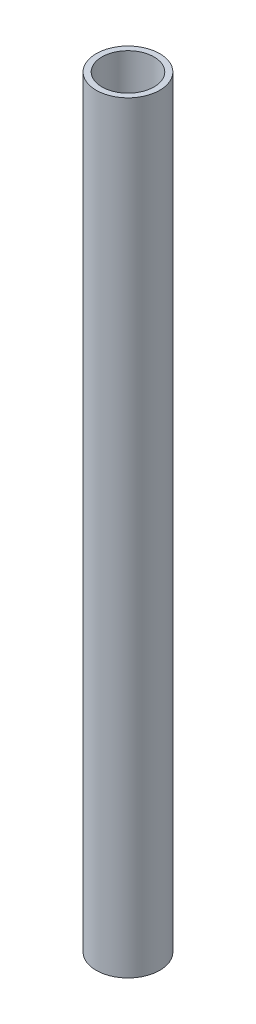
ISO-10303-21;
HEADER;
FILE_DESCRIPTION(('STEP AP214'),'2;1');
FILE_NAME('part.step','',(''),(''),'','','');
FILE_SCHEMA(('AUTOMOTIVE_DESIGN { 1 0 10303 214 1 1 1 1 }'));
ENDSEC;
DATA;
#1=APPLICATION_CONTEXT('core data for automotive mechanical design processes');
#2=APPLICATION_PROTOCOL_DEFINITION('international standard','automotive_design',2000,#1);
#3=PRODUCT_CONTEXT('',#1,'mechanical');
#4=PRODUCT('Part','Part','',(#3));
#5=PRODUCT_RELATED_PRODUCT_CATEGORY('part','',(#4));
#6=PRODUCT_DEFINITION_FORMATION('','',#4);
#7=PRODUCT_DEFINITION_CONTEXT('part definition',#1,'design');
#8=PRODUCT_DEFINITION('design','',#6,#7);
#9=PRODUCT_DEFINITION_SHAPE('','',#8);
#10=(LENGTH_UNIT() NAMED_UNIT(*) SI_UNIT(.MILLI.,.METRE.));
#11=(NAMED_UNIT(*) PLANE_ANGLE_UNIT() SI_UNIT($,.RADIAN.));
#12=(NAMED_UNIT(*) SI_UNIT($,.STERADIAN.) SOLID_ANGLE_UNIT());
#13=UNCERTAINTY_MEASURE_WITH_UNIT(LENGTH_MEASURE(1.E-05),#10,'distance_accuracy_value','');
#14=(GEOMETRIC_REPRESENTATION_CONTEXT(3) GLOBAL_UNCERTAINTY_ASSIGNED_CONTEXT((#13)) GLOBAL_UNIT_ASSIGNED_CONTEXT((#10,
#11,#12)) REPRESENTATION_CONTEXT('',''));
#15=CARTESIAN_POINT('',(0.,0.,0.));
#16=DIRECTION('',(0.,0.,1.));
#17=DIRECTION('',(1.,0.,0.));
#18=AXIS2_PLACEMENT_3D('',#15,#16,#17);
#19=CARTESIAN_POINT('',(0.,304.8,0.));
#20=DIRECTION('',(0.,1.,0.));
#21=DIRECTION('',(0.,0.,1.));
#22=AXIS2_PLACEMENT_3D('',#19,#20,#21);
#23=PLANE('',#22);
#24=CARTESIAN_POINT('',(0.,304.8,0.));
#25=DIRECTION('',(0.,1.,0.));
#26=DIRECTION('',(0.,0.,1.));
#27=AXIS2_PLACEMENT_3D('',#24,#25,#26);
#28=CIRCLE('',#27,12.7);
#29=CARTESIAN_POINT('',(0.,304.8,12.7));
#30=VERTEX_POINT('',#29);
#31=EDGE_CURVE('E10',#30,#30,#28,.T.);
#32=ORIENTED_EDGE('',*,*,#31,.T.);
#33=EDGE_LOOP('',(#32));
#34=FACE_BOUND('',#33,.T.);
#35=CARTESIAN_POINT('',(0.,304.8,0.));
#36=DIRECTION('',(0.,1.,0.));
#37=DIRECTION('',(0.,0.,1.));
#38=AXIS2_PLACEMENT_3D('',#35,#36,#37);
#39=CIRCLE('',#38,10.414);
#40=CARTESIAN_POINT('',(0.,304.8,10.414));
#41=VERTEX_POINT('',#40);
#42=EDGE_CURVE('E42',#41,#41,#39,.T.);
#43=ORIENTED_EDGE('',*,*,#42,.F.);
#44=EDGE_LOOP('',(#43));
#45=FACE_BOUND('',#44,.T.);
#46=ADVANCED_FACE('F31',(#34,#45),#23,.T.);
#47=CARTESIAN_POINT('',(0.,0.,0.));
#48=DIRECTION('',(0.,1.,0.));
#49=DIRECTION('',(0.,0.,1.));
#50=AXIS2_PLACEMENT_3D('',#47,#48,#49);
#51=PLANE('',#50);
#52=CARTESIAN_POINT('',(0.,0.,0.));
#53=DIRECTION('',(0.,1.,0.));
#54=DIRECTION('',(0.,0.,1.));
#55=AXIS2_PLACEMENT_3D('',#52,#53,#54);
#56=CIRCLE('',#55,12.7);
#57=CARTESIAN_POINT('',(0.,0.,12.7));
#58=VERTEX_POINT('',#57);
#59=EDGE_CURVE('E35',#58,#58,#56,.T.);
#60=ORIENTED_EDGE('',*,*,#59,.F.);
#61=EDGE_LOOP('',(#60));
#62=FACE_BOUND('',#61,.T.);
#63=CARTESIAN_POINT('',(0.,0.,0.));
#64=DIRECTION('',(0.,1.,0.));
#65=DIRECTION('',(0.,0.,1.));
#66=AXIS2_PLACEMENT_3D('',#63,#64,#65);
#67=CIRCLE('',#66,10.414);
#68=CARTESIAN_POINT('',(0.,0.,10.414));
#69=VERTEX_POINT('',#68);
#70=EDGE_CURVE('E44',#69,#69,#67,.T.);
#71=ORIENTED_EDGE('',*,*,#70,.T.);
#72=EDGE_LOOP('',(#71));
#73=FACE_BOUND('',#72,.T.);
#74=ADVANCED_FACE('F54',(#62,#73),#51,.F.);
#75=CARTESIAN_POINT('',(0.,304.8,0.));
#76=DIRECTION('',(0.,-1.,0.));
#77=DIRECTION('',(0.,0.,-1.));
#78=AXIS2_PLACEMENT_3D('',#75,#76,#77);
#79=CYLINDRICAL_SURFACE('',#78,12.7);
#80=ORIENTED_EDGE('',*,*,#31,.F.);
#81=EDGE_LOOP('',(#80));
#82=FACE_BOUND('',#81,.T.);
#83=ORIENTED_EDGE('',*,*,#59,.T.);
#84=EDGE_LOOP('',(#83));
#85=FACE_BOUND('',#84,.T.);
#86=ADVANCED_FACE('F33',(#82,#85),#79,.T.);
#87=CARTESIAN_POINT('',(0.,304.8,0.));
#88=DIRECTION('',(0.,-1.,0.));
#89=DIRECTION('',(0.,0.,-1.));
#90=AXIS2_PLACEMENT_3D('',#87,#88,#89);
#91=CYLINDRICAL_SURFACE('',#90,10.414);
#92=ORIENTED_EDGE('',*,*,#42,.T.);
#93=EDGE_LOOP('',(#92));
#94=FACE_BOUND('',#93,.T.);
#95=ORIENTED_EDGE('',*,*,#70,.F.);
#96=EDGE_LOOP('',(#95));
#97=FACE_BOUND('',#96,.T.);
#98=ADVANCED_FACE('F50',(#94,#97),#91,.F.);
#99=CLOSED_SHELL('',(#46,#74,#86,#98));
#100=MANIFOLD_SOLID_BREP('B2',#99);
#101=ADVANCED_BREP_SHAPE_REPRESENTATION('',(#18,#100),#14);
#102=SHAPE_DEFINITION_REPRESENTATION(#9,#101);
ENDSEC;
END-ISO-10303-21;
